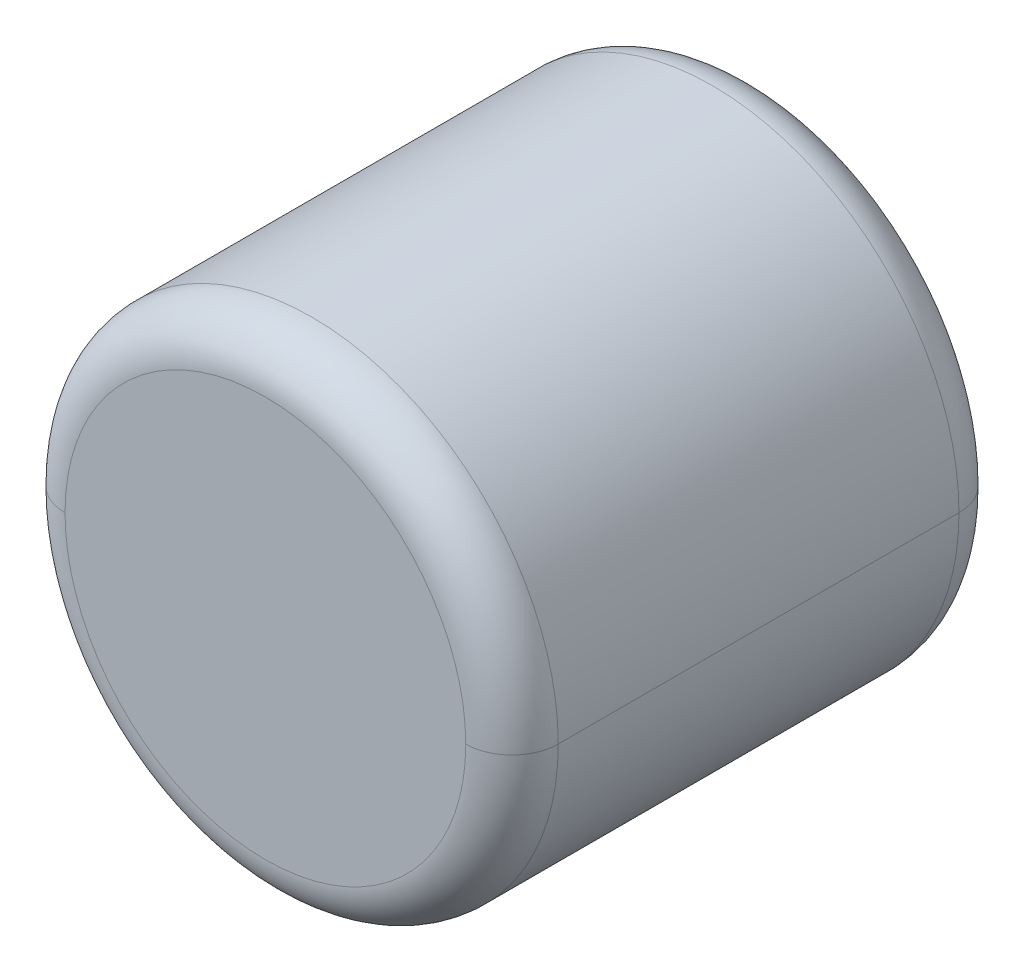
ISO-10303-21;
HEADER;
FILE_DESCRIPTION(('STEP AP214'),'2;1');
FILE_NAME('part.step','',(''),(''),'','','');
FILE_SCHEMA(('AUTOMOTIVE_DESIGN { 1 0 10303 214 1 1 1 1 }'));
ENDSEC;
DATA;
#1=APPLICATION_CONTEXT('core data for automotive mechanical design processes');
#2=APPLICATION_PROTOCOL_DEFINITION('international standard','automotive_design',2000,#1);
#3=PRODUCT_CONTEXT('',#1,'mechanical');
#4=PRODUCT('Part','Part','',(#3));
#5=PRODUCT_RELATED_PRODUCT_CATEGORY('part','',(#4));
#6=PRODUCT_DEFINITION_FORMATION('','',#4);
#7=PRODUCT_DEFINITION_CONTEXT('part definition',#1,'design');
#8=PRODUCT_DEFINITION('design','',#6,#7);
#9=PRODUCT_DEFINITION_SHAPE('','',#8);
#10=(LENGTH_UNIT() NAMED_UNIT(*) SI_UNIT(.MILLI.,.METRE.));
#11=(NAMED_UNIT(*) PLANE_ANGLE_UNIT() SI_UNIT($,.RADIAN.));
#12=(NAMED_UNIT(*) SI_UNIT($,.STERADIAN.) SOLID_ANGLE_UNIT());
#13=UNCERTAINTY_MEASURE_WITH_UNIT(LENGTH_MEASURE(1.E-05),#10,'distance_accuracy_value','');
#14=(GEOMETRIC_REPRESENTATION_CONTEXT(3) GLOBAL_UNCERTAINTY_ASSIGNED_CONTEXT((#13)) GLOBAL_UNIT_ASSIGNED_CONTEXT((#10,
#11,#12)) REPRESENTATION_CONTEXT('',''));
#15=CARTESIAN_POINT('',(0.,0.,0.));
#16=DIRECTION('',(0.,0.,1.));
#17=DIRECTION('',(1.,0.,0.));
#18=AXIS2_PLACEMENT_3D('',#15,#16,#17);
#19=CARTESIAN_POINT('',(0.,0.,-0.8));
#20=DIRECTION('',(0.,0.,1.));
#21=DIRECTION('',(1.,0.,0.));
#22=AXIS2_PLACEMENT_3D('',#19,#20,#21);
#23=CYLINDRICAL_SURFACE('',#22,0.8);
#24=DIRECTION('',(0.,0.,-1.));
#25=VECTOR('',#24,1.);
#26=CARTESIAN_POINT('',(-0.8,0.,0.65));
#27=LINE('',#26,#25);
#28=CARTESIAN_POINT('',(-0.8,0.,0.65));
#29=VERTEX_POINT('',#28);
#30=CARTESIAN_POINT('',(-0.8,0.,-0.65));
#31=VERTEX_POINT('',#30);
#32=EDGE_CURVE('E21',#29,#31,#27,.T.);
#33=ORIENTED_EDGE('',*,*,#32,.T.);
#34=CARTESIAN_POINT('',(0.,0.,-0.65));
#35=DIRECTION('',(0.,0.,1.));
#36=DIRECTION('',(-1.,0.,0.));
#37=AXIS2_PLACEMENT_3D('',#34,#35,#36);
#38=CIRCLE('',#37,0.8);
#39=CARTESIAN_POINT('',(-0.7999998409651,-0.0005044361219224,-0.65));
#40=VERTEX_POINT('',#39);
#41=EDGE_CURVE('E150',#31,#40,#38,.T.);
#42=ORIENTED_EDGE('',*,*,#41,.T.);
#43=CARTESIAN_POINT('',(0.,0.,-0.65));
#44=DIRECTION('',(0.,0.,1.));
#45=DIRECTION('',(-0.999999801206386,-0.000630545152402991,0.));
#46=AXIS2_PLACEMENT_3D('',#43,#44,#45);
#47=CIRCLE('',#46,0.8);
#48=CARTESIAN_POINT('',(0.8,0.,-0.65));
#49=VERTEX_POINT('',#48);
#50=EDGE_CURVE('E144',#40,#49,#47,.T.);
#51=ORIENTED_EDGE('',*,*,#50,.T.);
#52=DIRECTION('',(0.,0.,-1.));
#53=VECTOR('',#52,1.);
#54=CARTESIAN_POINT('',(0.8,0.,0.65));
#55=LINE('',#54,#53);
#56=CARTESIAN_POINT('',(0.8,0.,0.65));
#57=VERTEX_POINT('',#56);
#58=EDGE_CURVE('E133',#57,#49,#55,.T.);
#59=ORIENTED_EDGE('',*,*,#58,.F.);
#60=CARTESIAN_POINT('',(0.,0.,0.65));
#61=DIRECTION('',(0.,0.,-1.));
#62=DIRECTION('',(1.,0.,0.));
#63=AXIS2_PLACEMENT_3D('',#60,#61,#62);
#64=CIRCLE('',#63,0.8);
#65=CARTESIAN_POINT('',(0.799999921191,-0.0003550977686315,0.65));
#66=VERTEX_POINT('',#65);
#67=EDGE_CURVE('E11',#57,#66,#64,.T.);
#68=ORIENTED_EDGE('',*,*,#67,.T.);
#69=CARTESIAN_POINT('',(0.,0.,0.65));
#70=DIRECTION('',(0.,0.,-1.));
#71=DIRECTION('',(0.999999901488725,-0.000443872210789312,0.));
#72=AXIS2_PLACEMENT_3D('',#69,#70,#71);
#73=CIRCLE('',#72,0.8);
#74=EDGE_CURVE('E28',#66,#29,#73,.T.);
#75=ORIENTED_EDGE('',*,*,#74,.T.);
#76=EDGE_LOOP('',(#33,#42,#51,#59,#68,#75));
#77=FACE_BOUND('',#76,.T.);
#78=ADVANCED_FACE('F17',(#77),#23,.T.);
#79=CARTESIAN_POINT('',(0.,0.,0.65));
#80=DIRECTION('',(0.,0.,1.));
#81=DIRECTION('',(-0.999999901488725,0.000443872210789211,0.));
#82=AXIS2_PLACEMENT_3D('',#79,#80,#81);
#83=TOROIDAL_SURFACE('',#82,0.65,0.15);
#84=CARTESIAN_POINT('',(-0.65,0.,0.65));
#85=DIRECTION('',(0.,1.,0.));
#86=DIRECTION('',(-1.,0.,0.));
#87=AXIS2_PLACEMENT_3D('',#84,#85,#86);
#88=CIRCLE('',#87,0.15);
#89=CARTESIAN_POINT('',(-0.65,0.,0.8));
#90=VERTEX_POINT('',#89);
#91=EDGE_CURVE('E115',#29,#90,#88,.T.);
#92=ORIENTED_EDGE('',*,*,#91,.F.);
#93=ORIENTED_EDGE('',*,*,#74,.F.);
#94=ORIENTED_EDGE('',*,*,#67,.F.);
#95=CARTESIAN_POINT('',(0.65,0.,0.65));
#96=DIRECTION('',(0.,-1.,0.));
#97=DIRECTION('',(1.,0.,0.));
#98=AXIS2_PLACEMENT_3D('',#95,#96,#97);
#99=CIRCLE('',#98,0.15);
#100=CARTESIAN_POINT('',(0.65,0.,0.8));
#101=VERTEX_POINT('',#100);
#102=EDGE_CURVE('E112',#57,#101,#99,.T.);
#103=ORIENTED_EDGE('',*,*,#102,.T.);
#104=CARTESIAN_POINT('',(0.,0.,0.8));
#105=DIRECTION('',(0.,0.,-1.));
#106=DIRECTION('',(1.,0.,0.));
#107=AXIS2_PLACEMENT_3D('',#104,#105,#106);
#108=CIRCLE('',#107,0.65);
#109=EDGE_CURVE('E99',#101,#90,#108,.T.);
#110=ORIENTED_EDGE('',*,*,#109,.T.);
#111=EDGE_LOOP('',(#92,#93,#94,#103,#110));
#112=FACE_BOUND('',#111,.T.);
#113=ADVANCED_FACE('F118',(#112),#83,.T.);
#114=CARTESIAN_POINT('',(0.,0.,0.8));
#115=DIRECTION('',(0.,0.,1.));
#116=DIRECTION('',(1.,0.,0.));
#117=AXIS2_PLACEMENT_3D('',#114,#115,#116);
#118=PLANE('',#117);
#119=CARTESIAN_POINT('',(0.,0.,0.8));
#120=DIRECTION('',(0.,0.,-1.));
#121=DIRECTION('',(-1.,0.,0.));
#122=AXIS2_PLACEMENT_3D('',#119,#120,#121);
#123=CIRCLE('',#122,0.65);
#124=EDGE_CURVE('E102',#90,#101,#123,.T.);
#125=ORIENTED_EDGE('',*,*,#124,.F.);
#126=ORIENTED_EDGE('',*,*,#109,.F.);
#127=EDGE_LOOP('',(#125,#126));
#128=FACE_BOUND('',#127,.T.);
#129=ADVANCED_FACE('F101',(#128),#118,.T.);
#130=CARTESIAN_POINT('',(0.,0.,0.65));
#131=DIRECTION('',(0.,0.,1.));
#132=DIRECTION('',(0.999999901488725,-0.000443872210789011,0.));
#133=AXIS2_PLACEMENT_3D('',#130,#131,#132);
#134=TOROIDAL_SURFACE('',#133,0.65,0.15);
#135=ORIENTED_EDGE('',*,*,#102,.F.);
#136=CARTESIAN_POINT('',(0.,0.,0.65));
#137=DIRECTION('',(0.,0.,-1.));
#138=DIRECTION('',(-0.999999901488725,0.000443872210788812,0.));
#139=AXIS2_PLACEMENT_3D('',#136,#137,#138);
#140=CIRCLE('',#139,0.8);
#141=CARTESIAN_POINT('',(-0.799999921191,0.000355097768631,0.65));
#142=VERTEX_POINT('',#141);
#143=EDGE_CURVE('E120',#142,#57,#140,.T.);
#144=ORIENTED_EDGE('',*,*,#143,.F.);
#145=CARTESIAN_POINT('',(0.,0.,0.65));
#146=DIRECTION('',(0.,0.,-1.));
#147=DIRECTION('',(-1.,0.,0.));
#148=AXIS2_PLACEMENT_3D('',#145,#146,#147);
#149=CIRCLE('',#148,0.8);
#150=EDGE_CURVE('E127',#29,#142,#149,.T.);
#151=ORIENTED_EDGE('',*,*,#150,.F.);
#152=ORIENTED_EDGE('',*,*,#91,.T.);
#153=ORIENTED_EDGE('',*,*,#124,.T.);
#154=EDGE_LOOP('',(#135,#144,#151,#152,#153));
#155=FACE_BOUND('',#154,.T.);
#156=ADVANCED_FACE('F111',(#155),#134,.T.);
#157=CARTESIAN_POINT('',(0.,0.,-0.8));
#158=DIRECTION('',(0.,0.,1.));
#159=DIRECTION('',(1.,0.,0.));
#160=AXIS2_PLACEMENT_3D('',#157,#158,#159);
#161=CYLINDRICAL_SURFACE('',#160,0.8);
#162=ORIENTED_EDGE('',*,*,#58,.T.);
#163=CARTESIAN_POINT('',(0.,0.,-0.65));
#164=DIRECTION('',(0.,0.,1.));
#165=DIRECTION('',(1.,0.,0.));
#166=AXIS2_PLACEMENT_3D('',#163,#164,#165);
#167=CIRCLE('',#166,0.8);
#168=CARTESIAN_POINT('',(0.7999998409651,0.0005044361219226,-0.65));
#169=VERTEX_POINT('',#168);
#170=EDGE_CURVE('E130',#49,#169,#167,.T.);
#171=ORIENTED_EDGE('',*,*,#170,.T.);
#172=CARTESIAN_POINT('',(0.,0.,-0.65));
#173=DIRECTION('',(0.,0.,1.));
#174=DIRECTION('',(0.999999801206386,0.000630545152403191,0.));
#175=AXIS2_PLACEMENT_3D('',#172,#173,#174);
#176=CIRCLE('',#175,0.8);
#177=EDGE_CURVE('E149',#169,#31,#176,.T.);
#178=ORIENTED_EDGE('',*,*,#177,.T.);
#179=ORIENTED_EDGE('',*,*,#32,.F.);
#180=ORIENTED_EDGE('',*,*,#150,.T.);
#181=ORIENTED_EDGE('',*,*,#143,.T.);
#182=EDGE_LOOP('',(#162,#171,#178,#179,#180,#181));
#183=FACE_BOUND('',#182,.T.);
#184=ADVANCED_FACE('F186',(#183),#161,.T.);
#185=CARTESIAN_POINT('',(0.,0.,-0.65));
#186=DIRECTION('',(0.,0.,1.));
#187=DIRECTION('',(-0.999999801206386,-0.000630545152403891,0.));
#188=AXIS2_PLACEMENT_3D('',#185,#186,#187);
#189=TOROIDAL_SURFACE('',#188,0.65,0.15);
#190=CARTESIAN_POINT('',(-0.65,0.,-0.65));
#191=DIRECTION('',(0.,-1.,0.));
#192=DIRECTION('',(-1.,0.,0.));
#193=AXIS2_PLACEMENT_3D('',#190,#191,#192);
#194=CIRCLE('',#193,0.15);
#195=CARTESIAN_POINT('',(-0.65,0.,-0.8));
#196=VERTEX_POINT('',#195);
#197=EDGE_CURVE('E78',#31,#196,#194,.T.);
#198=ORIENTED_EDGE('',*,*,#197,.F.);
#199=ORIENTED_EDGE('',*,*,#177,.F.);
#200=ORIENTED_EDGE('',*,*,#170,.F.);
#201=CARTESIAN_POINT('',(0.65,0.,-0.65));
#202=DIRECTION('',(0.,1.,0.));
#203=DIRECTION('',(1.,0.,0.));
#204=AXIS2_PLACEMENT_3D('',#201,#202,#203);
#205=CIRCLE('',#204,0.15);
#206=CARTESIAN_POINT('',(0.65,0.,-0.8));
#207=VERTEX_POINT('',#206);
#208=EDGE_CURVE('E67',#49,#207,#205,.T.);
#209=ORIENTED_EDGE('',*,*,#208,.T.);
#210=CARTESIAN_POINT('',(0.,0.,-0.8));
#211=DIRECTION('',(0.,0.,1.));
#212=DIRECTION('',(1.,0.,0.));
#213=AXIS2_PLACEMENT_3D('',#210,#211,#212);
#214=CIRCLE('',#213,0.65);
#215=CARTESIAN_POINT('',(0.6499998707842,0.0004098543490621,-0.8));
#216=VERTEX_POINT('',#215);
#217=EDGE_CURVE('E87',#207,#216,#214,.T.);
#218=ORIENTED_EDGE('',*,*,#217,.T.);
#219=CARTESIAN_POINT('',(0.,0.,-0.8));
#220=DIRECTION('',(0.,0.,1.));
#221=DIRECTION('',(0.999999801206386,0.000630545152403291,0.));
#222=AXIS2_PLACEMENT_3D('',#219,#220,#221);
#223=CIRCLE('',#222,0.65);
#224=EDGE_CURVE('E146',#216,#196,#223,.T.);
#225=ORIENTED_EDGE('',*,*,#224,.T.);
#226=EDGE_LOOP('',(#198,#199,#200,#209,#218,#225));
#227=FACE_BOUND('',#226,.T.);
#228=ADVANCED_FACE('F174',(#227),#189,.T.);
#229=CARTESIAN_POINT('',(0.,0.,-0.65));
#230=DIRECTION('',(0.,0.,1.));
#231=DIRECTION('',(0.999999801206386,0.000630545152403791,0.));
#232=AXIS2_PLACEMENT_3D('',#229,#230,#231);
#233=TOROIDAL_SURFACE('',#232,0.65,0.15);
#234=ORIENTED_EDGE('',*,*,#208,.F.);
#235=ORIENTED_EDGE('',*,*,#50,.F.);
#236=ORIENTED_EDGE('',*,*,#41,.F.);
#237=ORIENTED_EDGE('',*,*,#197,.T.);
#238=CARTESIAN_POINT('',(0.,0.,-0.8));
#239=DIRECTION('',(0.,0.,1.));
#240=DIRECTION('',(-1.,0.,0.));
#241=AXIS2_PLACEMENT_3D('',#238,#239,#240);
#242=CIRCLE('',#241,0.65);
#243=CARTESIAN_POINT('',(-0.6499998707842,-0.0004098543490621,-0.8));
#244=VERTEX_POINT('',#243);
#245=EDGE_CURVE('E141',#196,#244,#242,.T.);
#246=ORIENTED_EDGE('',*,*,#245,.T.);
#247=CARTESIAN_POINT('',(0.,0.,-0.8));
#248=DIRECTION('',(0.,0.,1.));
#249=DIRECTION('',(-0.999999801206386,-0.000630545152403291,0.));
#250=AXIS2_PLACEMENT_3D('',#247,#248,#249);
#251=CIRCLE('',#250,0.65);
#252=EDGE_CURVE('E139',#244,#207,#251,.T.);
#253=ORIENTED_EDGE('',*,*,#252,.T.);
#254=EDGE_LOOP('',(#234,#235,#236,#237,#246,#253));
#255=FACE_BOUND('',#254,.T.);
#256=ADVANCED_FACE('F19',(#255),#233,.T.);
#257=CARTESIAN_POINT('',(0.,0.,-0.8));
#258=DIRECTION('',(0.,0.,1.));
#259=DIRECTION('',(1.,0.,0.));
#260=AXIS2_PLACEMENT_3D('',#257,#258,#259);
#261=PLANE('',#260);
#262=ORIENTED_EDGE('',*,*,#224,.F.);
#263=ORIENTED_EDGE('',*,*,#217,.F.);
#264=ORIENTED_EDGE('',*,*,#252,.F.);
#265=ORIENTED_EDGE('',*,*,#245,.F.);
#266=EDGE_LOOP('',(#262,#263,#264,#265));
#267=FACE_BOUND('',#266,.T.);
#268=ADVANCED_FACE('F173',(#267),#261,.F.);
#269=CLOSED_SHELL('',(#78,#113,#129,#156,#184,#228,#256,#268));
#270=MANIFOLD_SOLID_BREP('B1',#269);
#271=ADVANCED_BREP_SHAPE_REPRESENTATION('',(#18,#270),#14);
#272=SHAPE_DEFINITION_REPRESENTATION(#9,#271);
ENDSEC;
END-ISO-10303-21;
